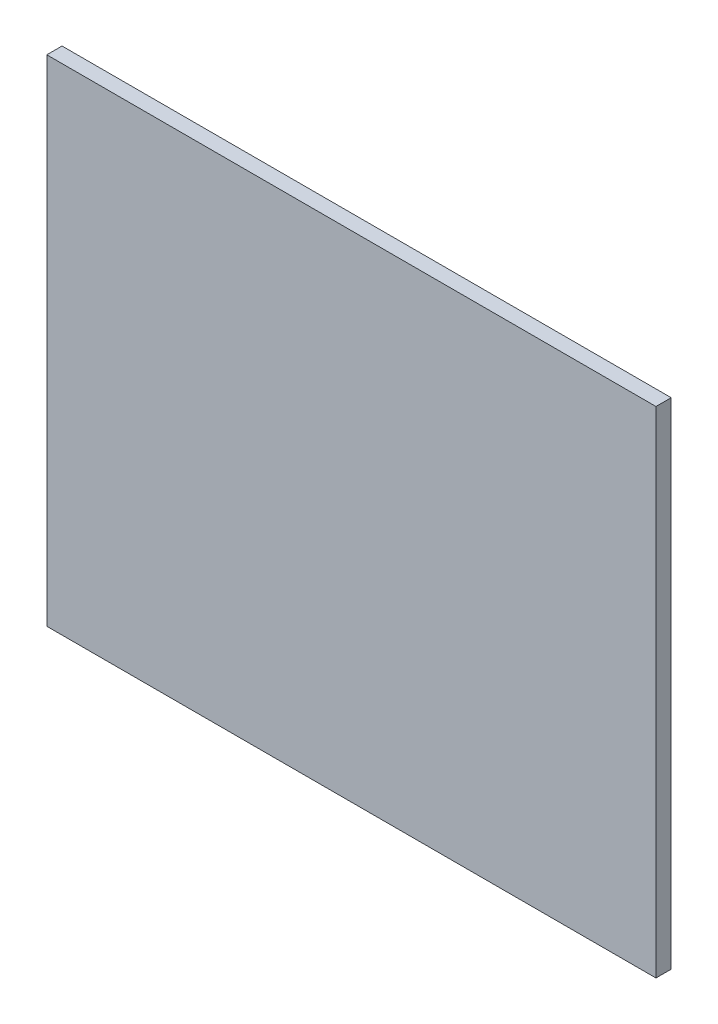
ISO-10303-21;
HEADER;
FILE_DESCRIPTION(('STEP AP214'),'2;1');
FILE_NAME('part.step','',(''),(''),'','','');
FILE_SCHEMA(('AUTOMOTIVE_DESIGN { 1 0 10303 214 1 1 1 1 }'));
ENDSEC;
DATA;
#1=APPLICATION_CONTEXT('core data for automotive mechanical design processes');
#2=APPLICATION_PROTOCOL_DEFINITION('international standard','automotive_design',2000,#1);
#3=PRODUCT_CONTEXT('',#1,'mechanical');
#4=PRODUCT('Part','Part','',(#3));
#5=PRODUCT_RELATED_PRODUCT_CATEGORY('part','',(#4));
#6=PRODUCT_DEFINITION_FORMATION('','',#4);
#7=PRODUCT_DEFINITION_CONTEXT('part definition',#1,'design');
#8=PRODUCT_DEFINITION('design','',#6,#7);
#9=PRODUCT_DEFINITION_SHAPE('','',#8);
#10=(LENGTH_UNIT() NAMED_UNIT(*) SI_UNIT(.MILLI.,.METRE.));
#11=(NAMED_UNIT(*) PLANE_ANGLE_UNIT() SI_UNIT($,.RADIAN.));
#12=(NAMED_UNIT(*) SI_UNIT($,.STERADIAN.) SOLID_ANGLE_UNIT());
#13=UNCERTAINTY_MEASURE_WITH_UNIT(LENGTH_MEASURE(1.E-05),#10,'distance_accuracy_value','');
#14=(GEOMETRIC_REPRESENTATION_CONTEXT(3) GLOBAL_UNCERTAINTY_ASSIGNED_CONTEXT((#13)) GLOBAL_UNIT_ASSIGNED_CONTEXT((#10,
#11,#12)) REPRESENTATION_CONTEXT('',''));
#15=CARTESIAN_POINT('',(0.,0.,0.));
#16=DIRECTION('',(0.,0.,1.));
#17=DIRECTION('',(1.,0.,0.));
#18=AXIS2_PLACEMENT_3D('',#15,#16,#17);
#19=CARTESIAN_POINT('',(400.,-325.,20.));
#20=DIRECTION('',(-1.,0.,0.));
#21=DIRECTION('',(0.,0.,1.));
#22=AXIS2_PLACEMENT_3D('',#19,#20,#21);
#23=PLANE('',#22);
#24=DIRECTION('',(0.,1.,0.));
#25=VECTOR('',#24,1.);
#26=CARTESIAN_POINT('',(400.,-325.,0.));
#27=LINE('',#26,#25);
#28=CARTESIAN_POINT('',(400.,-325.,0.));
#29=VERTEX_POINT('',#28);
#30=CARTESIAN_POINT('',(400.,325.,0.));
#31=VERTEX_POINT('',#30);
#32=EDGE_CURVE('E98',#29,#31,#27,.T.);
#33=ORIENTED_EDGE('',*,*,#32,.T.);
#34=DIRECTION('',(0.,0.,-1.));
#35=VECTOR('',#34,1.);
#36=CARTESIAN_POINT('',(400.,325.,20.));
#37=LINE('',#36,#35);
#38=CARTESIAN_POINT('',(400.,325.,20.));
#39=VERTEX_POINT('',#38);
#40=EDGE_CURVE('E11',#39,#31,#37,.T.);
#41=ORIENTED_EDGE('',*,*,#40,.F.);
#42=DIRECTION('',(0.,1.,0.));
#43=VECTOR('',#42,1.);
#44=CARTESIAN_POINT('',(400.,-325.,20.));
#45=LINE('',#44,#43);
#46=CARTESIAN_POINT('',(400.,-325.,20.));
#47=VERTEX_POINT('',#46);
#48=EDGE_CURVE('E86',#47,#39,#45,.T.);
#49=ORIENTED_EDGE('',*,*,#48,.F.);
#50=DIRECTION('',(0.,0.,-1.));
#51=VECTOR('',#50,1.);
#52=CARTESIAN_POINT('',(400.,-325.,20.));
#53=LINE('',#52,#51);
#54=EDGE_CURVE('E94',#47,#29,#53,.T.);
#55=ORIENTED_EDGE('',*,*,#54,.T.);
#56=EDGE_LOOP('',(#33,#41,#49,#55));
#57=FACE_BOUND('',#56,.T.);
#58=ADVANCED_FACE('F35',(#57),#23,.F.);
#59=CARTESIAN_POINT('',(-400.,325.,20.));
#60=DIRECTION('',(0.,-1.,0.));
#61=DIRECTION('',(0.,0.,-1.));
#62=AXIS2_PLACEMENT_3D('',#59,#60,#61);
#63=PLANE('',#62);
#64=DIRECTION('',(-1.,0.,0.));
#65=VECTOR('',#64,1.);
#66=CARTESIAN_POINT('',(-400.,325.,0.));
#67=LINE('',#66,#65);
#68=CARTESIAN_POINT('',(-400.,325.,0.));
#69=VERTEX_POINT('',#68);
#70=EDGE_CURVE('E90',#31,#69,#67,.T.);
#71=ORIENTED_EDGE('',*,*,#70,.T.);
#72=DIRECTION('',(0.,0.,-1.));
#73=VECTOR('',#72,1.);
#74=CARTESIAN_POINT('',(-400.,325.,20.));
#75=LINE('',#74,#73);
#76=CARTESIAN_POINT('',(-400.,325.,20.));
#77=VERTEX_POINT('',#76);
#78=EDGE_CURVE('E43',#77,#69,#75,.T.);
#79=ORIENTED_EDGE('',*,*,#78,.F.);
#80=DIRECTION('',(-1.,0.,0.));
#81=VECTOR('',#80,1.);
#82=CARTESIAN_POINT('',(-400.,325.,20.));
#83=LINE('',#82,#81);
#84=EDGE_CURVE('E81',#39,#77,#83,.T.);
#85=ORIENTED_EDGE('',*,*,#84,.F.);
#86=ORIENTED_EDGE('',*,*,#40,.T.);
#87=EDGE_LOOP('',(#71,#79,#85,#86));
#88=FACE_BOUND('',#87,.T.);
#89=ADVANCED_FACE('F89',(#88),#63,.F.);
#90=CARTESIAN_POINT('',(-400.,-325.,20.));
#91=DIRECTION('',(1.,0.,0.));
#92=DIRECTION('',(0.,0.,-1.));
#93=AXIS2_PLACEMENT_3D('',#90,#91,#92);
#94=PLANE('',#93);
#95=DIRECTION('',(0.,-1.,0.));
#96=VECTOR('',#95,1.);
#97=CARTESIAN_POINT('',(-400.,-325.,0.));
#98=LINE('',#97,#96);
#99=CARTESIAN_POINT('',(-400.,-325.,0.));
#100=VERTEX_POINT('',#99);
#101=EDGE_CURVE('E68',#69,#100,#98,.T.);
#102=ORIENTED_EDGE('',*,*,#101,.T.);
#103=DIRECTION('',(0.,0.,-1.));
#104=VECTOR('',#103,1.);
#105=CARTESIAN_POINT('',(-400.,-325.,20.));
#106=LINE('',#105,#104);
#107=CARTESIAN_POINT('',(-400.,-325.,20.));
#108=VERTEX_POINT('',#107);
#109=EDGE_CURVE('E91',#108,#100,#106,.T.);
#110=ORIENTED_EDGE('',*,*,#109,.F.);
#111=DIRECTION('',(0.,-1.,0.));
#112=VECTOR('',#111,1.);
#113=CARTESIAN_POINT('',(-400.,-325.,20.));
#114=LINE('',#113,#112);
#115=EDGE_CURVE('E84',#77,#108,#114,.T.);
#116=ORIENTED_EDGE('',*,*,#115,.F.);
#117=ORIENTED_EDGE('',*,*,#78,.T.);
#118=EDGE_LOOP('',(#102,#110,#116,#117));
#119=FACE_BOUND('',#118,.T.);
#120=ADVANCED_FACE('F92',(#119),#94,.F.);
#121=CARTESIAN_POINT('',(-400.,-325.,20.));
#122=DIRECTION('',(0.,1.,0.));
#123=DIRECTION('',(0.,0.,1.));
#124=AXIS2_PLACEMENT_3D('',#121,#122,#123);
#125=PLANE('',#124);
#126=DIRECTION('',(1.,0.,0.));
#127=VECTOR('',#126,1.);
#128=CARTESIAN_POINT('',(-400.,-325.,0.));
#129=LINE('',#128,#127);
#130=EDGE_CURVE('E74',#100,#29,#129,.T.);
#131=ORIENTED_EDGE('',*,*,#130,.T.);
#132=ORIENTED_EDGE('',*,*,#54,.F.);
#133=DIRECTION('',(1.,0.,0.));
#134=VECTOR('',#133,1.);
#135=CARTESIAN_POINT('',(-400.,-325.,20.));
#136=LINE('',#135,#134);
#137=EDGE_CURVE('E51',#108,#47,#136,.T.);
#138=ORIENTED_EDGE('',*,*,#137,.F.);
#139=ORIENTED_EDGE('',*,*,#109,.T.);
#140=EDGE_LOOP('',(#131,#132,#138,#139));
#141=FACE_BOUND('',#140,.T.);
#142=ADVANCED_FACE('F105',(#141),#125,.F.);
#143=CARTESIAN_POINT('',(0.,0.,20.));
#144=DIRECTION('',(0.,0.,-1.));
#145=DIRECTION('',(-1.,0.,0.));
#146=AXIS2_PLACEMENT_3D('',#143,#144,#145);
#147=PLANE('',#146);
#148=ORIENTED_EDGE('',*,*,#48,.T.);
#149=ORIENTED_EDGE('',*,*,#84,.T.);
#150=ORIENTED_EDGE('',*,*,#115,.T.);
#151=ORIENTED_EDGE('',*,*,#137,.T.);
#152=EDGE_LOOP('',(#148,#149,#150,#151));
#153=FACE_BOUND('',#152,.T.);
#154=ADVANCED_FACE('F82',(#153),#147,.F.);
#155=CARTESIAN_POINT('',(0.,0.,0.));
#156=DIRECTION('',(0.,0.,-1.));
#157=DIRECTION('',(-1.,0.,0.));
#158=AXIS2_PLACEMENT_3D('',#155,#156,#157);
#159=PLANE('',#158);
#160=ORIENTED_EDGE('',*,*,#32,.F.);
#161=ORIENTED_EDGE('',*,*,#130,.F.);
#162=ORIENTED_EDGE('',*,*,#101,.F.);
#163=ORIENTED_EDGE('',*,*,#70,.F.);
#164=EDGE_LOOP('',(#160,#161,#162,#163));
#165=FACE_BOUND('',#164,.T.);
#166=ADVANCED_FACE('F108',(#165),#159,.T.);
#167=CLOSED_SHELL('',(#58,#89,#120,#142,#154,#166));
#168=MANIFOLD_SOLID_BREP('B2',#167);
#169=ADVANCED_BREP_SHAPE_REPRESENTATION('',(#18,#168),#14);
#170=SHAPE_DEFINITION_REPRESENTATION(#9,#169);
ENDSEC;
END-ISO-10303-21;
